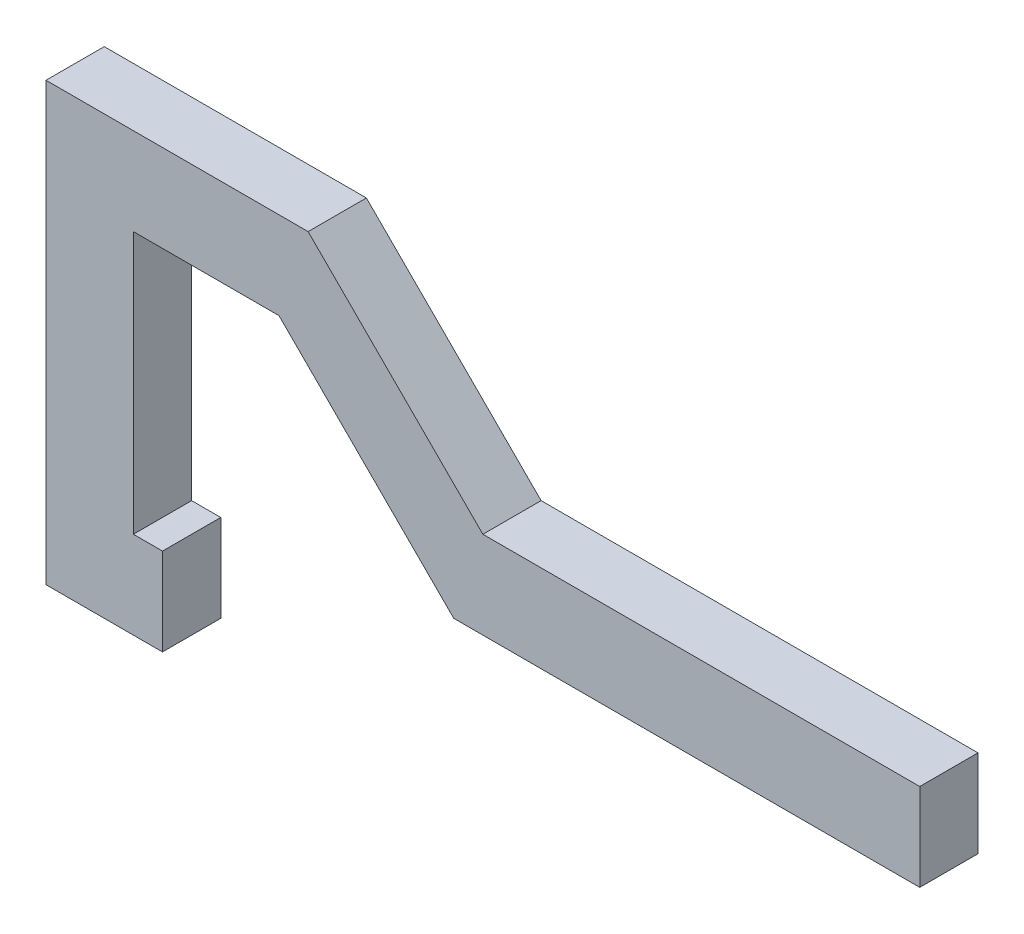
ISO-10303-21;
HEADER;
FILE_DESCRIPTION(('STEP AP214'),'2;1');
FILE_NAME('part.step','',(''),(''),'','','');
FILE_SCHEMA(('AUTOMOTIVE_DESIGN { 1 0 10303 214 1 1 1 1 }'));
ENDSEC;
DATA;
#1=APPLICATION_CONTEXT('core data for automotive mechanical design processes');
#2=APPLICATION_PROTOCOL_DEFINITION('international standard','automotive_design',2000,#1);
#3=PRODUCT_CONTEXT('',#1,'mechanical');
#4=PRODUCT('Part','Part','',(#3));
#5=PRODUCT_RELATED_PRODUCT_CATEGORY('part','',(#4));
#6=PRODUCT_DEFINITION_FORMATION('','',#4);
#7=PRODUCT_DEFINITION_CONTEXT('part definition',#1,'design');
#8=PRODUCT_DEFINITION('design','',#6,#7);
#9=PRODUCT_DEFINITION_SHAPE('','',#8);
#10=(LENGTH_UNIT() NAMED_UNIT(*) SI_UNIT(.MILLI.,.METRE.));
#11=(NAMED_UNIT(*) PLANE_ANGLE_UNIT() SI_UNIT($,.RADIAN.));
#12=(NAMED_UNIT(*) SI_UNIT($,.STERADIAN.) SOLID_ANGLE_UNIT());
#13=UNCERTAINTY_MEASURE_WITH_UNIT(LENGTH_MEASURE(1.E-05),#10,'distance_accuracy_value','');
#14=(GEOMETRIC_REPRESENTATION_CONTEXT(3) GLOBAL_UNCERTAINTY_ASSIGNED_CONTEXT((#13)) GLOBAL_UNIT_ASSIGNED_CONTEXT((#10,
#11,#12)) REPRESENTATION_CONTEXT('',''));
#15=CARTESIAN_POINT('',(0.,0.,0.));
#16=DIRECTION('',(0.,0.,1.));
#17=DIRECTION('',(1.,0.,0.));
#18=AXIS2_PLACEMENT_3D('',#15,#16,#17);
#19=CARTESIAN_POINT('',(-0.1905,-0.09525000000002,0.0254));
#20=DIRECTION('',(0.,0.,-1.));
#21=DIRECTION('',(-1.,0.,0.));
#22=AXIS2_PLACEMENT_3D('',#19,#20,#21);
#23=PLANE('',#22);
#24=DIRECTION('',(0.,1.,0.));
#25=VECTOR('',#24,1.);
#26=CARTESIAN_POINT('',(-0.1397,-0.09525000000002,0.0254));
#27=LINE('',#26,#25);
#28=CARTESIAN_POINT('',(-0.1397,-0.09525000000002,0.0254));
#29=VERTEX_POINT('',#28);
#30=CARTESIAN_POINT('',(-0.1397,-0.05715000000001,0.0254));
#31=VERTEX_POINT('',#30);
#32=EDGE_CURVE('E156',#29,#31,#27,.T.);
#33=ORIENTED_EDGE('',*,*,#32,.T.);
#34=DIRECTION('',(1.,0.,0.));
#35=VECTOR('',#34,1.);
#36=CARTESIAN_POINT('',(-0.1397,-0.05715000000001,0.0254));
#37=LINE('',#36,#35);
#38=CARTESIAN_POINT('',(-0.1524,-0.05715000000001,0.0254));
#39=VERTEX_POINT('',#38);
#40=EDGE_CURVE('E152',#31,#39,#37,.F.);
#41=ORIENTED_EDGE('',*,*,#40,.T.);
#42=DIRECTION('',(0.,1.,0.));
#43=VECTOR('',#42,1.);
#44=CARTESIAN_POINT('',(-0.1524,-0.05715000000001,0.0254));
#45=LINE('',#44,#43);
#46=CARTESIAN_POINT('',(-0.1524,0.05714999999998,0.0254));
#47=VERTEX_POINT('',#46);
#48=EDGE_CURVE('E148',#39,#47,#45,.T.);
#49=ORIENTED_EDGE('',*,*,#48,.T.);
#50=DIRECTION('',(1.,0.,0.));
#51=VECTOR('',#50,1.);
#52=CARTESIAN_POINT('',(-0.1524,0.05714999999998,0.0254));
#53=LINE('',#52,#51);
#54=CARTESIAN_POINT('',(-0.08890000000001,0.05714999999998,0.0254));
#55=VERTEX_POINT('',#54);
#56=EDGE_CURVE('E144',#47,#55,#53,.T.);
#57=ORIENTED_EDGE('',*,*,#56,.T.);
#58=DIRECTION('',(-0.707106781186548,0.707106781186548,0.));
#59=VECTOR('',#58,1.);
#60=CARTESIAN_POINT('',(-0.08890000000001,0.05714999999998,0.0254));
#61=LINE('',#60,#59);
#62=CARTESIAN_POINT('',(-0.01270000000001,-0.01905000000002,0.0254));
#63=VERTEX_POINT('',#62);
#64=EDGE_CURVE('E140',#55,#63,#61,.F.);
#65=ORIENTED_EDGE('',*,*,#64,.T.);
#66=DIRECTION('',(1.,0.,0.));
#67=VECTOR('',#66,1.);
#68=CARTESIAN_POINT('',(-0.01270000000001,-0.01905000000002,0.0254));
#69=LINE('',#68,#67);
#70=CARTESIAN_POINT('',(0.1905,-0.01905000000002,0.0254));
#71=VERTEX_POINT('',#70);
#72=EDGE_CURVE('E136',#63,#71,#69,.T.);
#73=ORIENTED_EDGE('',*,*,#72,.T.);
#74=DIRECTION('',(0.,1.,0.));
#75=VECTOR('',#74,1.);
#76=CARTESIAN_POINT('',(0.1905,-0.01905000000002,0.0254));
#77=LINE('',#76,#75);
#78=CARTESIAN_POINT('',(0.1905,0.01904999999999,0.0254));
#79=VERTEX_POINT('',#78);
#80=EDGE_CURVE('E132',#71,#79,#77,.T.);
#81=ORIENTED_EDGE('',*,*,#80,.T.);
#82=DIRECTION('',(1.,0.,0.));
#83=VECTOR('',#82,1.);
#84=CARTESIAN_POINT('',(0.1905,0.01904999999999,0.0254));
#85=LINE('',#84,#83);
#86=CARTESIAN_POINT('',(0.,0.01904999999999,0.0254));
#87=VERTEX_POINT('',#86);
#88=EDGE_CURVE('E128',#79,#87,#85,.F.);
#89=ORIENTED_EDGE('',*,*,#88,.T.);
#90=DIRECTION('',(0.707106781186548,-0.707106781186548,0.));
#91=VECTOR('',#90,1.);
#92=CARTESIAN_POINT('',(0.,0.01904999999999,0.0254));
#93=LINE('',#92,#91);
#94=CARTESIAN_POINT('',(-0.0762,0.09524999999999,0.0254));
#95=VERTEX_POINT('',#94);
#96=EDGE_CURVE('E104',#87,#95,#93,.F.);
#97=ORIENTED_EDGE('',*,*,#96,.T.);
#98=DIRECTION('',(1.,0.,0.));
#99=VECTOR('',#98,1.);
#100=CARTESIAN_POINT('',(-0.0762,0.09524999999999,0.0254));
#101=LINE('',#100,#99);
#102=CARTESIAN_POINT('',(-0.1905,0.09524999999999,0.0254));
#103=VERTEX_POINT('',#102);
#104=EDGE_CURVE('E106',#95,#103,#101,.F.);
#105=ORIENTED_EDGE('',*,*,#104,.T.);
#106=DIRECTION('',(0.,1.,0.));
#107=VECTOR('',#106,1.);
#108=CARTESIAN_POINT('',(-0.1905,0.09524999999999,0.0254));
#109=LINE('',#108,#107);
#110=CARTESIAN_POINT('',(-0.1905,-0.09525000000002,0.0254));
#111=VERTEX_POINT('',#110);
#112=EDGE_CURVE('E20',#103,#111,#109,.F.);
#113=ORIENTED_EDGE('',*,*,#112,.T.);
#114=DIRECTION('',(1.,0.,0.));
#115=VECTOR('',#114,1.);
#116=CARTESIAN_POINT('',(-0.1905,-0.09525000000002,0.0254));
#117=LINE('',#116,#115);
#118=EDGE_CURVE('E161',#111,#29,#117,.T.);
#119=ORIENTED_EDGE('',*,*,#118,.T.);
#120=EDGE_LOOP('',(#33,#41,#49,#57,#65,#73,#81,#89,#97,#105,#113,#119));
#121=FACE_BOUND('',#120,.T.);
#122=ADVANCED_FACE('F17',(#121),#23,.F.);
#123=CARTESIAN_POINT('',(-0.1905,0.09524999999999,0.));
#124=DIRECTION('',(1.,0.,0.));
#125=DIRECTION('',(0.,0.,-1.));
#126=AXIS2_PLACEMENT_3D('',#123,#124,#125);
#127=PLANE('',#126);
#128=DIRECTION('',(0.,0.,1.));
#129=VECTOR('',#128,1.);
#130=CARTESIAN_POINT('',(-0.1905,-0.09525000000002,0.));
#131=LINE('',#130,#129);
#132=CARTESIAN_POINT('',(-0.1905,-0.09525000000002,0.));
#133=VERTEX_POINT('',#132);
#134=EDGE_CURVE('E117',#133,#111,#131,.T.);
#135=ORIENTED_EDGE('',*,*,#134,.T.);
#136=ORIENTED_EDGE('',*,*,#112,.F.);
#137=DIRECTION('',(0.,0.,-1.));
#138=VECTOR('',#137,1.);
#139=CARTESIAN_POINT('',(-0.1905,0.09524999999999,0.));
#140=LINE('',#139,#138);
#141=CARTESIAN_POINT('',(-0.1905,0.09524999999999,0.));
#142=VERTEX_POINT('',#141);
#143=EDGE_CURVE('E112',#103,#142,#140,.T.);
#144=ORIENTED_EDGE('',*,*,#143,.T.);
#145=DIRECTION('',(0.,1.,0.));
#146=VECTOR('',#145,1.);
#147=CARTESIAN_POINT('',(-0.1905,-0.09525000000002,0.));
#148=LINE('',#147,#146);
#149=EDGE_CURVE('E164',#133,#142,#148,.T.);
#150=ORIENTED_EDGE('',*,*,#149,.F.);
#151=EDGE_LOOP('',(#135,#136,#144,#150));
#152=FACE_BOUND('',#151,.T.);
#153=ADVANCED_FACE('F114',(#152),#127,.F.);
#154=CARTESIAN_POINT('',(-0.0762,0.09524999999999,0.));
#155=DIRECTION('',(0.,-1.,0.));
#156=DIRECTION('',(0.,0.,-1.));
#157=AXIS2_PLACEMENT_3D('',#154,#155,#156);
#158=PLANE('',#157);
#159=ORIENTED_EDGE('',*,*,#143,.F.);
#160=ORIENTED_EDGE('',*,*,#104,.F.);
#161=DIRECTION('',(0.,0.,1.));
#162=VECTOR('',#161,1.);
#163=CARTESIAN_POINT('',(-0.0762,0.09524999999999,0.));
#164=LINE('',#163,#162);
#165=CARTESIAN_POINT('',(-0.0762,0.09524999999999,0.));
#166=VERTEX_POINT('',#165);
#167=EDGE_CURVE('E124',#95,#166,#164,.F.);
#168=ORIENTED_EDGE('',*,*,#167,.T.);
#169=DIRECTION('',(-1.,0.,0.));
#170=VECTOR('',#169,1.);
#171=CARTESIAN_POINT('',(-0.1905,0.09524999999999,0.));
#172=LINE('',#171,#170);
#173=EDGE_CURVE('E121',#142,#166,#172,.F.);
#174=ORIENTED_EDGE('',*,*,#173,.F.);
#175=EDGE_LOOP('',(#159,#160,#168,#174));
#176=FACE_BOUND('',#175,.T.);
#177=ADVANCED_FACE('F119',(#176),#158,.F.);
#178=CARTESIAN_POINT('',(0.,0.01904999999999,0.));
#179=DIRECTION('',(-0.707106781186548,-0.707106781186548,0.));
#180=DIRECTION('',(0.707106781186548,-0.707106781186548,0.));
#181=AXIS2_PLACEMENT_3D('',#178,#179,#180);
#182=PLANE('',#181);
#183=ORIENTED_EDGE('',*,*,#167,.F.);
#184=ORIENTED_EDGE('',*,*,#96,.F.);
#185=DIRECTION('',(0.,0.,-1.));
#186=VECTOR('',#185,1.);
#187=CARTESIAN_POINT('',(0.,0.01904999999999,0.));
#188=LINE('',#187,#186);
#189=CARTESIAN_POINT('',(0.,0.01904999999999,0.));
#190=VERTEX_POINT('',#189);
#191=EDGE_CURVE('E130',#87,#190,#188,.T.);
#192=ORIENTED_EDGE('',*,*,#191,.T.);
#193=DIRECTION('',(0.707106781186548,-0.707106781186548,0.));
#194=VECTOR('',#193,1.);
#195=CARTESIAN_POINT('',(-0.0762,0.09524999999999,0.));
#196=LINE('',#195,#194);
#197=EDGE_CURVE('E167',#166,#190,#196,.T.);
#198=ORIENTED_EDGE('',*,*,#197,.F.);
#199=EDGE_LOOP('',(#183,#184,#192,#198));
#200=FACE_BOUND('',#199,.T.);
#201=ADVANCED_FACE('F232',(#200),#182,.F.);
#202=CARTESIAN_POINT('',(0.1905,0.01904999999999,0.));
#203=DIRECTION('',(0.,-1.,0.));
#204=DIRECTION('',(0.,0.,-1.));
#205=AXIS2_PLACEMENT_3D('',#202,#203,#204);
#206=PLANE('',#205);
#207=ORIENTED_EDGE('',*,*,#191,.F.);
#208=ORIENTED_EDGE('',*,*,#88,.F.);
#209=DIRECTION('',(0.,0.,1.));
#210=VECTOR('',#209,1.);
#211=CARTESIAN_POINT('',(0.1905,0.01904999999999,0.));
#212=LINE('',#211,#210);
#213=CARTESIAN_POINT('',(0.1905,0.01904999999999,0.));
#214=VERTEX_POINT('',#213);
#215=EDGE_CURVE('E134',#79,#214,#212,.F.);
#216=ORIENTED_EDGE('',*,*,#215,.T.);
#217=DIRECTION('',(-1.,0.,0.));
#218=VECTOR('',#217,1.);
#219=CARTESIAN_POINT('',(-0.1905,0.01904999999999,0.));
#220=LINE('',#219,#218);
#221=EDGE_CURVE('E170',#190,#214,#220,.F.);
#222=ORIENTED_EDGE('',*,*,#221,.F.);
#223=EDGE_LOOP('',(#207,#208,#216,#222));
#224=FACE_BOUND('',#223,.T.);
#225=ADVANCED_FACE('F230',(#224),#206,.F.);
#226=CARTESIAN_POINT('',(0.1905,-0.01905000000002,0.));
#227=DIRECTION('',(-1.,0.,0.));
#228=DIRECTION('',(0.,0.,1.));
#229=AXIS2_PLACEMENT_3D('',#226,#227,#228);
#230=PLANE('',#229);
#231=ORIENTED_EDGE('',*,*,#215,.F.);
#232=ORIENTED_EDGE('',*,*,#80,.F.);
#233=DIRECTION('',(0.,0.,1.));
#234=VECTOR('',#233,1.);
#235=CARTESIAN_POINT('',(0.1905,-0.01905000000002,0.));
#236=LINE('',#235,#234);
#237=CARTESIAN_POINT('',(0.1905,-0.01905000000002,0.));
#238=VERTEX_POINT('',#237);
#239=EDGE_CURVE('E138',#71,#238,#236,.F.);
#240=ORIENTED_EDGE('',*,*,#239,.T.);
#241=DIRECTION('',(0.,1.,0.));
#242=VECTOR('',#241,1.);
#243=CARTESIAN_POINT('',(0.1905,-0.09525000000002,0.));
#244=LINE('',#243,#242);
#245=EDGE_CURVE('E173',#214,#238,#244,.F.);
#246=ORIENTED_EDGE('',*,*,#245,.F.);
#247=EDGE_LOOP('',(#231,#232,#240,#246));
#248=FACE_BOUND('',#247,.T.);
#249=ADVANCED_FACE('F225',(#248),#230,.F.);
#250=CARTESIAN_POINT('',(-0.01270000000001,-0.01905000000002,0.));
#251=DIRECTION('',(0.,1.,0.));
#252=DIRECTION('',(0.,0.,1.));
#253=AXIS2_PLACEMENT_3D('',#250,#251,#252);
#254=PLANE('',#253);
#255=ORIENTED_EDGE('',*,*,#239,.F.);
#256=ORIENTED_EDGE('',*,*,#72,.F.);
#257=DIRECTION('',(0.,0.,1.));
#258=VECTOR('',#257,1.);
#259=CARTESIAN_POINT('',(-0.01270000000001,-0.01905000000002,0.));
#260=LINE('',#259,#258);
#261=CARTESIAN_POINT('',(-0.01270000000001,-0.01905000000002,0.));
#262=VERTEX_POINT('',#261);
#263=EDGE_CURVE('E142',#63,#262,#260,.F.);
#264=ORIENTED_EDGE('',*,*,#263,.T.);
#265=DIRECTION('',(-1.,0.,0.));
#266=VECTOR('',#265,1.);
#267=CARTESIAN_POINT('',(-0.1905,-0.01905000000002,0.));
#268=LINE('',#267,#266);
#269=EDGE_CURVE('E176',#238,#262,#268,.T.);
#270=ORIENTED_EDGE('',*,*,#269,.F.);
#271=EDGE_LOOP('',(#255,#256,#264,#270));
#272=FACE_BOUND('',#271,.T.);
#273=ADVANCED_FACE('F220',(#272),#254,.F.);
#274=CARTESIAN_POINT('',(-0.08890000000001,0.05714999999998,0.));
#275=DIRECTION('',(0.707106781186548,0.707106781186548,0.));
#276=DIRECTION('',(-0.707106781186548,0.707106781186548,0.));
#277=AXIS2_PLACEMENT_3D('',#274,#275,#276);
#278=PLANE('',#277);
#279=ORIENTED_EDGE('',*,*,#263,.F.);
#280=ORIENTED_EDGE('',*,*,#64,.F.);
#281=DIRECTION('',(0.,0.,1.));
#282=VECTOR('',#281,1.);
#283=CARTESIAN_POINT('',(-0.08890000000001,0.05714999999998,0.));
#284=LINE('',#283,#282);
#285=CARTESIAN_POINT('',(-0.08890000000001,0.05714999999998,0.));
#286=VERTEX_POINT('',#285);
#287=EDGE_CURVE('E146',#55,#286,#284,.F.);
#288=ORIENTED_EDGE('',*,*,#287,.T.);
#289=DIRECTION('',(-0.707106781186547,0.707106781186548,0.));
#290=VECTOR('',#289,1.);
#291=CARTESIAN_POINT('',(-0.01270000000001,-0.01905000000002,0.));
#292=LINE('',#291,#290);
#293=EDGE_CURVE('E179',#262,#286,#292,.T.);
#294=ORIENTED_EDGE('',*,*,#293,.F.);
#295=EDGE_LOOP('',(#279,#280,#288,#294));
#296=FACE_BOUND('',#295,.T.);
#297=ADVANCED_FACE('F215',(#296),#278,.F.);
#298=CARTESIAN_POINT('',(-0.1524,0.05714999999998,0.));
#299=DIRECTION('',(0.,1.,0.));
#300=DIRECTION('',(0.,0.,1.));
#301=AXIS2_PLACEMENT_3D('',#298,#299,#300);
#302=PLANE('',#301);
#303=ORIENTED_EDGE('',*,*,#287,.F.);
#304=ORIENTED_EDGE('',*,*,#56,.F.);
#305=DIRECTION('',(0.,0.,1.));
#306=VECTOR('',#305,1.);
#307=CARTESIAN_POINT('',(-0.1524,0.05714999999998,0.));
#308=LINE('',#307,#306);
#309=CARTESIAN_POINT('',(-0.1524,0.05714999999998,0.));
#310=VERTEX_POINT('',#309);
#311=EDGE_CURVE('E150',#47,#310,#308,.F.);
#312=ORIENTED_EDGE('',*,*,#311,.T.);
#313=DIRECTION('',(-1.,0.,0.));
#314=VECTOR('',#313,1.);
#315=CARTESIAN_POINT('',(-0.1905,0.05714999999998,0.));
#316=LINE('',#315,#314);
#317=EDGE_CURVE('E182',#286,#310,#316,.T.);
#318=ORIENTED_EDGE('',*,*,#317,.F.);
#319=EDGE_LOOP('',(#303,#304,#312,#318));
#320=FACE_BOUND('',#319,.T.);
#321=ADVANCED_FACE('F210',(#320),#302,.F.);
#322=CARTESIAN_POINT('',(-0.1524,-0.05715000000001,0.));
#323=DIRECTION('',(-1.,0.,0.));
#324=DIRECTION('',(0.,0.,1.));
#325=AXIS2_PLACEMENT_3D('',#322,#323,#324);
#326=PLANE('',#325);
#327=ORIENTED_EDGE('',*,*,#311,.F.);
#328=ORIENTED_EDGE('',*,*,#48,.F.);
#329=DIRECTION('',(0.,0.,-1.));
#330=VECTOR('',#329,1.);
#331=CARTESIAN_POINT('',(-0.1524,-0.05715000000001,0.));
#332=LINE('',#331,#330);
#333=CARTESIAN_POINT('',(-0.1524,-0.05715000000001,0.));
#334=VERTEX_POINT('',#333);
#335=EDGE_CURVE('E154',#39,#334,#332,.T.);
#336=ORIENTED_EDGE('',*,*,#335,.T.);
#337=DIRECTION('',(0.,1.,0.));
#338=VECTOR('',#337,1.);
#339=CARTESIAN_POINT('',(-0.1524,-0.09525000000002,0.));
#340=LINE('',#339,#338);
#341=EDGE_CURVE('E185',#310,#334,#340,.F.);
#342=ORIENTED_EDGE('',*,*,#341,.F.);
#343=EDGE_LOOP('',(#327,#328,#336,#342));
#344=FACE_BOUND('',#343,.T.);
#345=ADVANCED_FACE('F205',(#344),#326,.F.);
#346=CARTESIAN_POINT('',(-0.1397,-0.05715000000001,0.));
#347=DIRECTION('',(0.,-1.,0.));
#348=DIRECTION('',(0.,0.,-1.));
#349=AXIS2_PLACEMENT_3D('',#346,#347,#348);
#350=PLANE('',#349);
#351=ORIENTED_EDGE('',*,*,#335,.F.);
#352=ORIENTED_EDGE('',*,*,#40,.F.);
#353=DIRECTION('',(0.,0.,1.));
#354=VECTOR('',#353,1.);
#355=CARTESIAN_POINT('',(-0.1397,-0.05715000000001,0.));
#356=LINE('',#355,#354);
#357=CARTESIAN_POINT('',(-0.1397,-0.05715000000001,0.));
#358=VERTEX_POINT('',#357);
#359=EDGE_CURVE('E158',#31,#358,#356,.F.);
#360=ORIENTED_EDGE('',*,*,#359,.T.);
#361=DIRECTION('',(-1.,0.,0.));
#362=VECTOR('',#361,1.);
#363=CARTESIAN_POINT('',(-0.1905,-0.05715000000001,0.));
#364=LINE('',#363,#362);
#365=EDGE_CURVE('E188',#334,#358,#364,.F.);
#366=ORIENTED_EDGE('',*,*,#365,.F.);
#367=EDGE_LOOP('',(#351,#352,#360,#366));
#368=FACE_BOUND('',#367,.T.);
#369=ADVANCED_FACE('F200',(#368),#350,.F.);
#370=CARTESIAN_POINT('',(-0.1397,-0.09525000000002,0.));
#371=DIRECTION('',(-1.,0.,0.));
#372=DIRECTION('',(0.,0.,1.));
#373=AXIS2_PLACEMENT_3D('',#370,#371,#372);
#374=PLANE('',#373);
#375=ORIENTED_EDGE('',*,*,#359,.F.);
#376=ORIENTED_EDGE('',*,*,#32,.F.);
#377=DIRECTION('',(0.,0.,1.));
#378=VECTOR('',#377,1.);
#379=CARTESIAN_POINT('',(-0.1397,-0.09525000000002,0.));
#380=LINE('',#379,#378);
#381=CARTESIAN_POINT('',(-0.1397,-0.09525000000002,0.));
#382=VERTEX_POINT('',#381);
#383=EDGE_CURVE('E35',#29,#382,#380,.F.);
#384=ORIENTED_EDGE('',*,*,#383,.T.);
#385=DIRECTION('',(0.,1.,0.));
#386=VECTOR('',#385,1.);
#387=CARTESIAN_POINT('',(-0.1397,-0.09525000000002,0.));
#388=LINE('',#387,#386);
#389=EDGE_CURVE('E26',#358,#382,#388,.F.);
#390=ORIENTED_EDGE('',*,*,#389,.F.);
#391=EDGE_LOOP('',(#375,#376,#384,#390));
#392=FACE_BOUND('',#391,.T.);
#393=ADVANCED_FACE('F196',(#392),#374,.F.);
#394=CARTESIAN_POINT('',(-0.1905,-0.09525000000002,0.));
#395=DIRECTION('',(0.,1.,0.));
#396=DIRECTION('',(0.,0.,1.));
#397=AXIS2_PLACEMENT_3D('',#394,#395,#396);
#398=PLANE('',#397);
#399=ORIENTED_EDGE('',*,*,#383,.F.);
#400=ORIENTED_EDGE('',*,*,#118,.F.);
#401=ORIENTED_EDGE('',*,*,#134,.F.);
#402=DIRECTION('',(-1.,0.,0.));
#403=VECTOR('',#402,1.);
#404=CARTESIAN_POINT('',(-0.1905,-0.09525000000002,0.));
#405=LINE('',#404,#403);
#406=EDGE_CURVE('E11',#382,#133,#405,.T.);
#407=ORIENTED_EDGE('',*,*,#406,.F.);
#408=EDGE_LOOP('',(#399,#400,#401,#407));
#409=FACE_BOUND('',#408,.T.);
#410=ADVANCED_FACE('F235',(#409),#398,.F.);
#411=CARTESIAN_POINT('',(-0.1905,-0.09525000000002,0.));
#412=DIRECTION('',(0.,0.,-1.));
#413=DIRECTION('',(-1.,0.,0.));
#414=AXIS2_PLACEMENT_3D('',#411,#412,#413);
#415=PLANE('',#414);
#416=ORIENTED_EDGE('',*,*,#389,.T.);
#417=ORIENTED_EDGE('',*,*,#406,.T.);
#418=ORIENTED_EDGE('',*,*,#149,.T.);
#419=ORIENTED_EDGE('',*,*,#173,.T.);
#420=ORIENTED_EDGE('',*,*,#197,.T.);
#421=ORIENTED_EDGE('',*,*,#221,.T.);
#422=ORIENTED_EDGE('',*,*,#245,.T.);
#423=ORIENTED_EDGE('',*,*,#269,.T.);
#424=ORIENTED_EDGE('',*,*,#293,.T.);
#425=ORIENTED_EDGE('',*,*,#317,.T.);
#426=ORIENTED_EDGE('',*,*,#341,.T.);
#427=ORIENTED_EDGE('',*,*,#365,.T.);
#428=EDGE_LOOP('',(#416,#417,#418,#419,#420,#421,#422,#423,#424,#425,#426,#427));
#429=FACE_BOUND('',#428,.T.);
#430=ADVANCED_FACE('F193',(#429),#415,.T.);
#431=CLOSED_SHELL('',(#122,#153,#177,#201,#225,#249,#273,#297,#321,#345,#369,#393,#410,#430));
#432=MANIFOLD_SOLID_BREP('B1',#431);
#433=ADVANCED_BREP_SHAPE_REPRESENTATION('',(#18,#432),#14);
#434=SHAPE_DEFINITION_REPRESENTATION(#9,#433);
ENDSEC;
END-ISO-10303-21;
